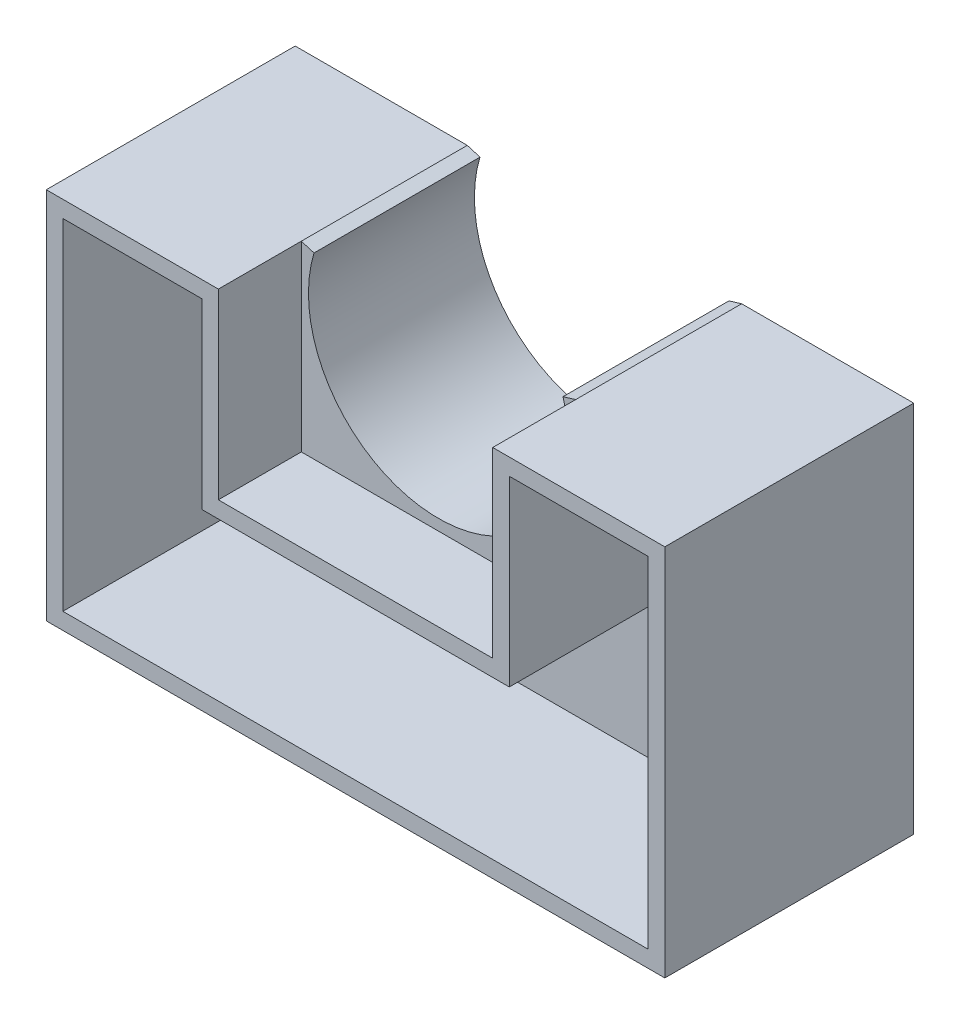
ISO-10303-21;
HEADER;
FILE_DESCRIPTION(('STEP AP214'),'2;1');
FILE_NAME('part.step','',(''),(''),'','','');
FILE_SCHEMA(('AUTOMOTIVE_DESIGN { 1 0 10303 214 1 1 1 1 }'));
ENDSEC;
DATA;
#1=APPLICATION_CONTEXT('core data for automotive mechanical design processes');
#2=APPLICATION_PROTOCOL_DEFINITION('international standard','automotive_design',2000,#1);
#3=PRODUCT_CONTEXT('',#1,'mechanical');
#4=PRODUCT('Part','Part','',(#3));
#5=PRODUCT_RELATED_PRODUCT_CATEGORY('part','',(#4));
#6=PRODUCT_DEFINITION_FORMATION('','',#4);
#7=PRODUCT_DEFINITION_CONTEXT('part definition',#1,'design');
#8=PRODUCT_DEFINITION('design','',#6,#7);
#9=PRODUCT_DEFINITION_SHAPE('','',#8);
#10=(LENGTH_UNIT() NAMED_UNIT(*) SI_UNIT(.MILLI.,.METRE.));
#11=(NAMED_UNIT(*) PLANE_ANGLE_UNIT() SI_UNIT($,.RADIAN.));
#12=(NAMED_UNIT(*) SI_UNIT($,.STERADIAN.) SOLID_ANGLE_UNIT());
#13=UNCERTAINTY_MEASURE_WITH_UNIT(LENGTH_MEASURE(1.E-05),#10,'distance_accuracy_value','');
#14=(GEOMETRIC_REPRESENTATION_CONTEXT(3) GLOBAL_UNCERTAINTY_ASSIGNED_CONTEXT((#13)) GLOBAL_UNIT_ASSIGNED_CONTEXT((#10,
#11,#12)) REPRESENTATION_CONTEXT('',''));
#15=CARTESIAN_POINT('',(0.,0.,0.));
#16=DIRECTION('',(0.,0.,1.));
#17=DIRECTION('',(1.,0.,0.));
#18=AXIS2_PLACEMENT_3D('',#15,#16,#17);
#19=CARTESIAN_POINT('',(10.4991216084109,3.17734995322597,12.7));
#20=DIRECTION('',(0.289656522601476,-0.957130659269893,0.));
#21=DIRECTION('',(0.957130659269893,0.289656522601476,0.));
#22=AXIS2_PLACEMENT_3D('',#19,#20,#21);
#23=PLANE('',#22);
#24=DIRECTION('',(-0.957130659269893,-0.289656522601476,0.));
#25=VECTOR('',#24,1.);
#26=CARTESIAN_POINT('',(10.4991216084109,3.17734995322597,0.));
#27=LINE('',#26,#25);
#28=CARTESIAN_POINT('',(10.4991216084109,3.17734995322597,0.));
#29=VERTEX_POINT('',#28);
#30=CARTESIAN_POINT('',(9.52667685859272,2.88305892626287,0.));
#31=VERTEX_POINT('',#30);
#32=EDGE_CURVE('E394',#29,#31,#27,.T.);
#33=ORIENTED_EDGE('',*,*,#32,.T.);
#34=DIRECTION('',(0.,0.,-1.));
#35=VECTOR('',#34,1.);
#36=CARTESIAN_POINT('',(9.52667685859272,2.88305892626287,12.7));
#37=LINE('',#36,#35);
#38=CARTESIAN_POINT('',(9.52667685859272,2.88305892626287,12.7));
#39=VERTEX_POINT('',#38);
#40=EDGE_CURVE('E40',#39,#31,#37,.T.);
#41=ORIENTED_EDGE('',*,*,#40,.F.);
#42=DIRECTION('',(-0.957130659269893,-0.289656522601476,0.));
#43=VECTOR('',#42,1.);
#44=CARTESIAN_POINT('',(10.4991216084109,3.17734995322597,12.7));
#45=LINE('',#44,#43);
#46=CARTESIAN_POINT('',(10.4991216084109,3.17734995322597,12.7));
#47=VERTEX_POINT('',#46);
#48=EDGE_CURVE('E395',#47,#39,#45,.T.);
#49=ORIENTED_EDGE('',*,*,#48,.F.);
#50=DIRECTION('',(0.,0.,-1.));
#51=VECTOR('',#50,1.);
#52=CARTESIAN_POINT('',(10.4991216084109,3.17734995322597,12.7));
#53=LINE('',#52,#51);
#54=EDGE_CURVE('E11',#47,#29,#53,.T.);
#55=ORIENTED_EDGE('',*,*,#54,.T.);
#56=EDGE_LOOP('',(#33,#41,#49,#55));
#57=FACE_BOUND('',#56,.T.);
#58=ADVANCED_FACE('F33',(#57),#23,.F.);
#59=CARTESIAN_POINT('',(0.,0.,12.7));
#60=DIRECTION('',(0.,0.,-1.));
#61=DIRECTION('',(-1.,0.,0.));
#62=AXIS2_PLACEMENT_3D('',#59,#60,#61);
#63=CYLINDRICAL_SURFACE('',#62,9.95337132535253);
#64=CARTESIAN_POINT('',(0.,0.,0.));
#65=DIRECTION('',(0.,0.,-1.));
#66=DIRECTION('',(1.,0.,0.));
#67=AXIS2_PLACEMENT_3D('',#64,#65,#66);
#68=CIRCLE('',#67,9.95337132535253);
#69=CARTESIAN_POINT('',(-9.5266768585927,2.88305892626291,0.));
#70=VERTEX_POINT('',#69);
#71=EDGE_CURVE('E404',#31,#70,#68,.T.);
#72=ORIENTED_EDGE('',*,*,#71,.T.);
#73=DIRECTION('',(0.,0.,-1.));
#74=VECTOR('',#73,1.);
#75=CARTESIAN_POINT('',(-9.5266768585927,2.88305892626291,12.7));
#76=LINE('',#75,#74);
#77=CARTESIAN_POINT('',(-9.5266768585927,2.88305892626291,12.7));
#78=VERTEX_POINT('',#77);
#79=EDGE_CURVE('E422',#78,#70,#76,.T.);
#80=ORIENTED_EDGE('',*,*,#79,.F.);
#81=CARTESIAN_POINT('',(0.,0.,12.7));
#82=DIRECTION('',(0.,0.,-1.));
#83=DIRECTION('',(1.,0.,0.));
#84=AXIS2_PLACEMENT_3D('',#81,#82,#83);
#85=CIRCLE('',#84,9.95337132535253);
#86=EDGE_CURVE('E397',#39,#78,#85,.T.);
#87=ORIENTED_EDGE('',*,*,#86,.F.);
#88=ORIENTED_EDGE('',*,*,#40,.T.);
#89=EDGE_LOOP('',(#72,#80,#87,#88));
#90=FACE_BOUND('',#89,.T.);
#91=ADVANCED_FACE('F429',(#90),#63,.F.);
#92=CARTESIAN_POINT('',(-9.5266768585927,2.88305892626291,12.7));
#93=DIRECTION('',(-0.289656522601482,-0.957130659269891,0.));
#94=DIRECTION('',(0.957130659269891,-0.289656522601482,0.));
#95=AXIS2_PLACEMENT_3D('',#92,#93,#94);
#96=PLANE('',#95);
#97=DIRECTION('',(-0.957130659269891,0.289656522601482,0.));
#98=VECTOR('',#97,1.);
#99=CARTESIAN_POINT('',(-9.5266768585927,2.88305892626291,0.));
#100=LINE('',#99,#98);
#101=CARTESIAN_POINT('',(-10.4991216084109,3.17734995322601,0.));
#102=VERTEX_POINT('',#101);
#103=EDGE_CURVE('E406',#70,#102,#100,.T.);
#104=ORIENTED_EDGE('',*,*,#103,.T.);
#105=DIRECTION('',(0.,0.,-1.));
#106=VECTOR('',#105,1.);
#107=CARTESIAN_POINT('',(-10.4991216084109,3.17734995322601,12.7));
#108=LINE('',#107,#106);
#109=CARTESIAN_POINT('',(-10.4991216084109,3.17734995322601,12.7));
#110=VERTEX_POINT('',#109);
#111=EDGE_CURVE('E419',#110,#102,#108,.T.);
#112=ORIENTED_EDGE('',*,*,#111,.F.);
#113=DIRECTION('',(-0.957130659269891,0.289656522601482,0.));
#114=VECTOR('',#113,1.);
#115=CARTESIAN_POINT('',(-9.5266768585927,2.88305892626291,12.7));
#116=LINE('',#115,#114);
#117=EDGE_CURVE('E400',#78,#110,#116,.T.);
#118=ORIENTED_EDGE('',*,*,#117,.F.);
#119=ORIENTED_EDGE('',*,*,#79,.T.);
#120=EDGE_LOOP('',(#104,#112,#118,#119));
#121=FACE_BOUND('',#120,.T.);
#122=ADVANCED_FACE('F440',(#121),#96,.F.);
#123=CARTESIAN_POINT('',(-23.6693713253525,-25.4,12.7));
#124=DIRECTION('',(1.,0.,0.));
#125=DIRECTION('',(0.,0.,-1.));
#126=AXIS2_PLACEMENT_3D('',#123,#124,#125);
#127=PLANE('',#126);
#128=DIRECTION('',(0.,-1.,0.));
#129=VECTOR('',#128,1.);
#130=CARTESIAN_POINT('',(-23.6693713253525,-25.4,0.));
#131=LINE('',#130,#129);
#132=CARTESIAN_POINT('',(-23.6693713253525,3.17734995322601,0.));
#133=VERTEX_POINT('',#132);
#134=CARTESIAN_POINT('',(-23.6693713253525,-25.4,0.));
#135=VERTEX_POINT('',#134);
#136=EDGE_CURVE('E409',#133,#135,#131,.T.);
#137=ORIENTED_EDGE('',*,*,#136,.T.);
#138=DIRECTION('',(0.,0.,-1.));
#139=VECTOR('',#138,1.);
#140=CARTESIAN_POINT('',(-23.6693713253525,-25.4,12.7));
#141=LINE('',#140,#139);
#142=CARTESIAN_POINT('',(-23.6693713253525,-25.4,19.05));
#143=VERTEX_POINT('',#142);
#144=EDGE_CURVE('E416',#143,#135,#141,.T.);
#145=ORIENTED_EDGE('',*,*,#144,.F.);
#146=DIRECTION('',(0.,-1.,0.));
#147=VECTOR('',#146,1.);
#148=CARTESIAN_POINT('',(-23.6693713253525,3.17734995322601,19.05));
#149=LINE('',#148,#147);
#150=CARTESIAN_POINT('',(-23.6693713253525,3.17734995322601,19.05));
#151=VERTEX_POINT('',#150);
#152=EDGE_CURVE('E347',#151,#143,#149,.T.);
#153=ORIENTED_EDGE('',*,*,#152,.F.);
#154=DIRECTION('',(0.,0.,1.));
#155=VECTOR('',#154,1.);
#156=CARTESIAN_POINT('',(-23.6693713253525,3.17734995322601,0.));
#157=LINE('',#156,#155);
#158=EDGE_CURVE('E387',#133,#151,#157,.T.);
#159=ORIENTED_EDGE('',*,*,#158,.F.);
#160=EDGE_LOOP('',(#137,#145,#153,#159));
#161=FACE_BOUND('',#160,.T.);
#162=ADVANCED_FACE('F467',(#161),#127,.F.);
#163=CARTESIAN_POINT('',(23.6693713253525,-25.4,12.7));
#164=DIRECTION('',(0.,1.,0.));
#165=DIRECTION('',(0.,0.,1.));
#166=AXIS2_PLACEMENT_3D('',#163,#164,#165);
#167=PLANE('',#166);
#168=DIRECTION('',(1.,0.,0.));
#169=VECTOR('',#168,1.);
#170=CARTESIAN_POINT('',(23.6693713253525,-25.4,0.));
#171=LINE('',#170,#169);
#172=CARTESIAN_POINT('',(23.6693713253525,-25.4,0.));
#173=VERTEX_POINT('',#172);
#174=EDGE_CURVE('E411',#135,#173,#171,.T.);
#175=ORIENTED_EDGE('',*,*,#174,.T.);
#176=DIRECTION('',(0.,0.,-1.));
#177=VECTOR('',#176,1.);
#178=CARTESIAN_POINT('',(23.6693713253525,-25.4,12.7));
#179=LINE('',#178,#177);
#180=CARTESIAN_POINT('',(23.6693713253525,-25.4,19.05));
#181=VERTEX_POINT('',#180);
#182=EDGE_CURVE('E402',#181,#173,#179,.T.);
#183=ORIENTED_EDGE('',*,*,#182,.F.);
#184=DIRECTION('',(1.,0.,0.));
#185=VECTOR('',#184,1.);
#186=CARTESIAN_POINT('',(-23.6693713253525,-25.4,19.05));
#187=LINE('',#186,#185);
#188=EDGE_CURVE('E351',#143,#181,#187,.T.);
#189=ORIENTED_EDGE('',*,*,#188,.F.);
#190=ORIENTED_EDGE('',*,*,#144,.T.);
#191=EDGE_LOOP('',(#175,#183,#189,#190));
#192=FACE_BOUND('',#191,.T.);
#193=ADVANCED_FACE('F460',(#192),#167,.F.);
#194=CARTESIAN_POINT('',(23.6693713253525,-19.05,12.7));
#195=DIRECTION('',(-1.,0.,0.));
#196=DIRECTION('',(0.,-1.,0.));
#197=AXIS2_PLACEMENT_3D('',#194,#195,#196);
#198=PLANE('',#197);
#199=DIRECTION('',(0.,1.,0.));
#200=VECTOR('',#199,1.);
#201=CARTESIAN_POINT('',(23.6693713253525,-19.05,0.));
#202=LINE('',#201,#200);
#203=CARTESIAN_POINT('',(23.6693713253525,3.17734995322597,0.));
#204=VERTEX_POINT('',#203);
#205=EDGE_CURVE('E398',#173,#204,#202,.T.);
#206=ORIENTED_EDGE('',*,*,#205,.T.);
#207=DIRECTION('',(0.,0.,-1.));
#208=VECTOR('',#207,1.);
#209=CARTESIAN_POINT('',(23.6693713253525,3.17734995322597,12.7));
#210=LINE('',#209,#208);
#211=CARTESIAN_POINT('',(23.6693713253525,3.17734995322597,19.05));
#212=VERTEX_POINT('',#211);
#213=EDGE_CURVE('E389',#212,#204,#210,.T.);
#214=ORIENTED_EDGE('',*,*,#213,.F.);
#215=DIRECTION('',(0.,1.,0.));
#216=VECTOR('',#215,1.);
#217=CARTESIAN_POINT('',(23.6693713253525,-25.4,19.05));
#218=LINE('',#217,#216);
#219=EDGE_CURVE('E354',#181,#212,#218,.T.);
#220=ORIENTED_EDGE('',*,*,#219,.F.);
#221=ORIENTED_EDGE('',*,*,#182,.T.);
#222=EDGE_LOOP('',(#206,#214,#220,#221));
#223=FACE_BOUND('',#222,.T.);
#224=ADVANCED_FACE('F456',(#223),#198,.F.);
#225=CARTESIAN_POINT('',(0.,0.,12.7));
#226=DIRECTION('',(0.,0.,1.));
#227=DIRECTION('',(1.,0.,0.));
#228=AXIS2_PLACEMENT_3D('',#225,#226,#227);
#229=PLANE('',#228);
#230=DIRECTION('',(0.,1.,0.));
#231=VECTOR('',#230,1.);
#232=CARTESIAN_POINT('',(-10.4991216084109,3.17734995322601,12.7));
#233=LINE('',#232,#231);
#234=CARTESIAN_POINT('',(-10.4991216084109,-10.792650046774,12.7));
#235=VERTEX_POINT('',#234);
#236=EDGE_CURVE('E348',#235,#110,#233,.T.);
#237=ORIENTED_EDGE('',*,*,#236,.F.);
#238=DIRECTION('',(-1.,0.,0.));
#239=VECTOR('',#238,1.);
#240=CARTESIAN_POINT('',(-10.4991216084109,-10.792650046774,12.7));
#241=LINE('',#240,#239);
#242=CARTESIAN_POINT('',(10.4991216084109,-10.792650046774,12.7));
#243=VERTEX_POINT('',#242);
#244=EDGE_CURVE('E368',#243,#235,#241,.T.);
#245=ORIENTED_EDGE('',*,*,#244,.F.);
#246=DIRECTION('',(0.,-1.,0.));
#247=VECTOR('',#246,1.);
#248=CARTESIAN_POINT('',(10.4991216084109,3.17734995322597,12.7));
#249=LINE('',#248,#247);
#250=EDGE_CURVE('E329',#47,#243,#249,.T.);
#251=ORIENTED_EDGE('',*,*,#250,.F.);
#252=ORIENTED_EDGE('',*,*,#48,.T.);
#253=ORIENTED_EDGE('',*,*,#86,.T.);
#254=ORIENTED_EDGE('',*,*,#117,.T.);
#255=EDGE_LOOP('',(#237,#245,#251,#252,#253,#254));
#256=FACE_BOUND('',#255,.T.);
#257=ADVANCED_FACE('F443',(#256),#229,.T.);
#258=CARTESIAN_POINT('',(0.,0.,0.));
#259=DIRECTION('',(0.,0.,1.));
#260=DIRECTION('',(1.,0.,0.));
#261=AXIS2_PLACEMENT_3D('',#258,#259,#260);
#262=PLANE('',#261);
#263=DIRECTION('',(-1.,0.,0.));
#264=VECTOR('',#263,1.);
#265=CARTESIAN_POINT('',(-2.54,-22.86,0.));
#266=LINE('',#265,#264);
#267=CARTESIAN_POINT('',(2.54,-22.86,0.));
#268=VERTEX_POINT('',#267);
#269=CARTESIAN_POINT('',(-2.54,-22.86,0.));
#270=VERTEX_POINT('',#269);
#271=EDGE_CURVE('E240',#268,#270,#266,.T.);
#272=ORIENTED_EDGE('',*,*,#271,.F.);
#273=DIRECTION('',(0.,-1.,0.));
#274=VECTOR('',#273,1.);
#275=CARTESIAN_POINT('',(2.54,-22.86,0.));
#276=LINE('',#275,#274);
#277=CARTESIAN_POINT('',(2.54,-12.7,0.));
#278=VERTEX_POINT('',#277);
#279=EDGE_CURVE('E47',#278,#268,#276,.T.);
#280=ORIENTED_EDGE('',*,*,#279,.F.);
#281=DIRECTION('',(1.,0.,0.));
#282=VECTOR('',#281,1.);
#283=CARTESIAN_POINT('',(-2.54,-12.7,0.));
#284=LINE('',#283,#282);
#285=CARTESIAN_POINT('',(-2.54,-12.7,0.));
#286=VERTEX_POINT('',#285);
#287=EDGE_CURVE('E231',#286,#278,#284,.T.);
#288=ORIENTED_EDGE('',*,*,#287,.F.);
#289=DIRECTION('',(0.,1.,0.));
#290=VECTOR('',#289,1.);
#291=CARTESIAN_POINT('',(-2.54,-22.86,0.));
#292=LINE('',#291,#290);
#293=EDGE_CURVE('E234',#270,#286,#292,.T.);
#294=ORIENTED_EDGE('',*,*,#293,.F.);
#295=EDGE_LOOP('',(#272,#280,#288,#294));
#296=FACE_BOUND('',#295,.T.);
#297=DIRECTION('',(-1.,0.,0.));
#298=VECTOR('',#297,1.);
#299=CARTESIAN_POINT('',(12.7,-2.54,0.));
#300=LINE('',#299,#298);
#301=CARTESIAN_POINT('',(22.86,-2.54,0.));
#302=VERTEX_POINT('',#301);
#303=CARTESIAN_POINT('',(12.7,-2.54,0.));
#304=VERTEX_POINT('',#303);
#305=EDGE_CURVE('E264',#302,#304,#300,.T.);
#306=ORIENTED_EDGE('',*,*,#305,.F.);
#307=DIRECTION('',(0.,-1.,0.));
#308=VECTOR('',#307,1.);
#309=CARTESIAN_POINT('',(22.86,-2.54,0.));
#310=LINE('',#309,#308);
#311=CARTESIAN_POINT('',(22.86,2.54,0.));
#312=VERTEX_POINT('',#311);
#313=EDGE_CURVE('E55',#312,#302,#310,.T.);
#314=ORIENTED_EDGE('',*,*,#313,.F.);
#315=DIRECTION('',(1.,0.,0.));
#316=VECTOR('',#315,1.);
#317=CARTESIAN_POINT('',(12.7,2.54,0.));
#318=LINE('',#317,#316);
#319=CARTESIAN_POINT('',(12.7,2.54,0.));
#320=VERTEX_POINT('',#319);
#321=EDGE_CURVE('E253',#320,#312,#318,.T.);
#322=ORIENTED_EDGE('',*,*,#321,.F.);
#323=DIRECTION('',(0.,1.,0.));
#324=VECTOR('',#323,1.);
#325=CARTESIAN_POINT('',(12.7,-2.54,0.));
#326=LINE('',#325,#324);
#327=EDGE_CURVE('E267',#304,#320,#326,.T.);
#328=ORIENTED_EDGE('',*,*,#327,.F.);
#329=EDGE_LOOP('',(#306,#314,#322,#328));
#330=FACE_BOUND('',#329,.T.);
#331=ORIENTED_EDGE('',*,*,#32,.F.);
#332=DIRECTION('',(-1.,0.,0.));
#333=VECTOR('',#332,1.);
#334=CARTESIAN_POINT('',(23.6693713253525,3.17734995322597,0.));
#335=LINE('',#334,#333);
#336=EDGE_CURVE('E392',#204,#29,#335,.T.);
#337=ORIENTED_EDGE('',*,*,#336,.F.);
#338=ORIENTED_EDGE('',*,*,#205,.F.);
#339=ORIENTED_EDGE('',*,*,#174,.F.);
#340=ORIENTED_EDGE('',*,*,#136,.F.);
#341=DIRECTION('',(-1.,0.,0.));
#342=VECTOR('',#341,1.);
#343=CARTESIAN_POINT('',(-10.9693713253525,3.17734995322601,0.));
#344=LINE('',#343,#342);
#345=EDGE_CURVE('E384',#102,#133,#344,.T.);
#346=ORIENTED_EDGE('',*,*,#345,.F.);
#347=ORIENTED_EDGE('',*,*,#103,.F.);
#348=ORIENTED_EDGE('',*,*,#71,.F.);
#349=EDGE_LOOP('',(#331,#337,#338,#339,#340,#346,#347,#348));
#350=FACE_BOUND('',#349,.T.);
#351=ADVANCED_FACE('F436',(#296,#330,#350),#262,.F.);
#352=CARTESIAN_POINT('',(0.,3.17734995322597,0.));
#353=DIRECTION('',(0.,1.,0.));
#354=DIRECTION('',(0.,0.,1.));
#355=AXIS2_PLACEMENT_3D('',#352,#353,#354);
#356=PLANE('',#355);
#357=ORIENTED_EDGE('',*,*,#213,.T.);
#358=ORIENTED_EDGE('',*,*,#336,.T.);
#359=ORIENTED_EDGE('',*,*,#54,.F.);
#360=DIRECTION('',(0.,0.,-1.));
#361=VECTOR('',#360,1.);
#362=CARTESIAN_POINT('',(10.4991216084109,3.17734995322597,19.05));
#363=LINE('',#362,#361);
#364=CARTESIAN_POINT('',(10.4991216084109,3.17734995322597,19.05));
#365=VERTEX_POINT('',#364);
#366=EDGE_CURVE('E381',#365,#47,#363,.T.);
#367=ORIENTED_EDGE('',*,*,#366,.F.);
#368=DIRECTION('',(-1.,0.,0.));
#369=VECTOR('',#368,1.);
#370=CARTESIAN_POINT('',(23.6693713253525,3.17734995322597,19.05));
#371=LINE('',#370,#369);
#372=EDGE_CURVE('E357',#212,#365,#371,.T.);
#373=ORIENTED_EDGE('',*,*,#372,.F.);
#374=EDGE_LOOP('',(#357,#358,#359,#367,#373));
#375=FACE_BOUND('',#374,.T.);
#376=ADVANCED_FACE('F452',(#375),#356,.T.);
#377=CARTESIAN_POINT('',(0.,3.17734995322601,0.));
#378=DIRECTION('',(0.,1.,0.));
#379=DIRECTION('',(0.,0.,1.));
#380=AXIS2_PLACEMENT_3D('',#377,#378,#379);
#381=PLANE('',#380);
#382=ORIENTED_EDGE('',*,*,#158,.T.);
#383=DIRECTION('',(-1.,0.,0.));
#384=VECTOR('',#383,1.);
#385=CARTESIAN_POINT('',(-23.6693713253525,3.17734995322601,19.05));
#386=LINE('',#385,#384);
#387=CARTESIAN_POINT('',(-10.4991216084109,3.17734995322601,19.05));
#388=VERTEX_POINT('',#387);
#389=EDGE_CURVE('E344',#388,#151,#386,.T.);
#390=ORIENTED_EDGE('',*,*,#389,.F.);
#391=DIRECTION('',(0.,0.,-1.));
#392=VECTOR('',#391,1.);
#393=CARTESIAN_POINT('',(-10.4991216084109,3.17734995322601,19.05));
#394=LINE('',#393,#392);
#395=EDGE_CURVE('E365',#388,#110,#394,.T.);
#396=ORIENTED_EDGE('',*,*,#395,.T.);
#397=ORIENTED_EDGE('',*,*,#111,.T.);
#398=ORIENTED_EDGE('',*,*,#345,.T.);
#399=EDGE_LOOP('',(#382,#390,#396,#397,#398));
#400=FACE_BOUND('',#399,.T.);
#401=ADVANCED_FACE('F469',(#400),#381,.T.);
#402=CARTESIAN_POINT('',(10.4991216084109,3.17734995322597,19.05));
#403=DIRECTION('',(1.,0.,0.));
#404=DIRECTION('',(0.,1.,0.));
#405=AXIS2_PLACEMENT_3D('',#402,#403,#404);
#406=PLANE('',#405);
#407=ORIENTED_EDGE('',*,*,#250,.T.);
#408=DIRECTION('',(0.,0.,-1.));
#409=VECTOR('',#408,1.);
#410=CARTESIAN_POINT('',(10.4991216084109,-10.792650046774,19.05));
#411=LINE('',#410,#409);
#412=CARTESIAN_POINT('',(10.4991216084109,-10.792650046774,19.05));
#413=VERTEX_POINT('',#412);
#414=EDGE_CURVE('E378',#413,#243,#411,.T.);
#415=ORIENTED_EDGE('',*,*,#414,.F.);
#416=DIRECTION('',(0.,-1.,0.));
#417=VECTOR('',#416,1.);
#418=CARTESIAN_POINT('',(10.4991216084109,3.17734995322597,19.05));
#419=LINE('',#418,#417);
#420=EDGE_CURVE('E359',#365,#413,#419,.T.);
#421=ORIENTED_EDGE('',*,*,#420,.F.);
#422=ORIENTED_EDGE('',*,*,#366,.T.);
#423=EDGE_LOOP('',(#407,#415,#421,#422));
#424=FACE_BOUND('',#423,.T.);
#425=ADVANCED_FACE('F448',(#424),#406,.F.);
#426=CARTESIAN_POINT('',(-10.4991216084109,-10.792650046774,19.05));
#427=DIRECTION('',(0.,-1.,0.));
#428=DIRECTION('',(0.,0.,-1.));
#429=AXIS2_PLACEMENT_3D('',#426,#427,#428);
#430=PLANE('',#429);
#431=ORIENTED_EDGE('',*,*,#244,.T.);
#432=DIRECTION('',(0.,0.,-1.));
#433=VECTOR('',#432,1.);
#434=CARTESIAN_POINT('',(-10.4991216084109,-10.792650046774,19.05));
#435=LINE('',#434,#433);
#436=CARTESIAN_POINT('',(-10.4991216084109,-10.792650046774,19.05));
#437=VERTEX_POINT('',#436);
#438=EDGE_CURVE('E375',#437,#235,#435,.T.);
#439=ORIENTED_EDGE('',*,*,#438,.F.);
#440=DIRECTION('',(-1.,0.,0.));
#441=VECTOR('',#440,1.);
#442=CARTESIAN_POINT('',(-10.4991216084109,-10.792650046774,19.05));
#443=LINE('',#442,#441);
#444=EDGE_CURVE('E361',#413,#437,#443,.T.);
#445=ORIENTED_EDGE('',*,*,#444,.F.);
#446=ORIENTED_EDGE('',*,*,#414,.T.);
#447=EDGE_LOOP('',(#431,#439,#445,#446));
#448=FACE_BOUND('',#447,.T.);
#449=ADVANCED_FACE('F477',(#448),#430,.F.);
#450=CARTESIAN_POINT('',(-10.4991216084109,3.17734995322601,19.05));
#451=DIRECTION('',(-1.,0.,0.));
#452=DIRECTION('',(0.,-1.,0.));
#453=AXIS2_PLACEMENT_3D('',#450,#451,#452);
#454=PLANE('',#453);
#455=ORIENTED_EDGE('',*,*,#236,.T.);
#456=ORIENTED_EDGE('',*,*,#395,.F.);
#457=DIRECTION('',(0.,1.,0.));
#458=VECTOR('',#457,1.);
#459=CARTESIAN_POINT('',(-10.4991216084109,3.17734995322601,19.05));
#460=LINE('',#459,#458);
#461=EDGE_CURVE('E363',#437,#388,#460,.T.);
#462=ORIENTED_EDGE('',*,*,#461,.F.);
#463=ORIENTED_EDGE('',*,*,#438,.T.);
#464=EDGE_LOOP('',(#455,#456,#462,#463));
#465=FACE_BOUND('',#464,.T.);
#466=ADVANCED_FACE('F473',(#465),#454,.F.);
#467=CARTESIAN_POINT('',(0.,0.,19.05));
#468=DIRECTION('',(0.,0.,-1.));
#469=DIRECTION('',(-1.,0.,0.));
#470=AXIS2_PLACEMENT_3D('',#467,#468,#469);
#471=PLANE('',#470);
#472=DIRECTION('',(-1.,0.,0.));
#473=VECTOR('',#472,1.);
#474=CARTESIAN_POINT('',(-11.7691216084109,1.90734995322601,19.05));
#475=LINE('',#474,#473);
#476=CARTESIAN_POINT('',(-11.7691216084109,1.90734995322601,19.05));
#477=VERTEX_POINT('',#476);
#478=CARTESIAN_POINT('',(-22.3993713253525,1.90734995322601,19.05));
#479=VERTEX_POINT('',#478);
#480=EDGE_CURVE('E307',#477,#479,#475,.T.);
#481=ORIENTED_EDGE('',*,*,#480,.F.);
#482=DIRECTION('',(0.,1.,0.));
#483=VECTOR('',#482,1.);
#484=CARTESIAN_POINT('',(-11.7691216084109,-12.062650046774,19.05));
#485=LINE('',#484,#483);
#486=CARTESIAN_POINT('',(-11.7691216084109,-12.062650046774,19.05));
#487=VERTEX_POINT('',#486);
#488=EDGE_CURVE('E274',#487,#477,#485,.T.);
#489=ORIENTED_EDGE('',*,*,#488,.F.);
#490=DIRECTION('',(-1.,0.,0.));
#491=VECTOR('',#490,1.);
#492=CARTESIAN_POINT('',(11.7691216084109,-12.062650046774,19.05));
#493=LINE('',#492,#491);
#494=CARTESIAN_POINT('',(11.7691216084109,-12.062650046774,19.05));
#495=VERTEX_POINT('',#494);
#496=EDGE_CURVE('E284',#495,#487,#493,.T.);
#497=ORIENTED_EDGE('',*,*,#496,.F.);
#498=DIRECTION('',(0.,-1.,0.));
#499=VECTOR('',#498,1.);
#500=CARTESIAN_POINT('',(11.7691216084109,1.90734995322597,19.05));
#501=LINE('',#500,#499);
#502=CARTESIAN_POINT('',(11.7691216084109,1.90734995322597,19.05));
#503=VERTEX_POINT('',#502);
#504=EDGE_CURVE('E322',#503,#495,#501,.T.);
#505=ORIENTED_EDGE('',*,*,#504,.F.);
#506=DIRECTION('',(-1.,0.,0.));
#507=VECTOR('',#506,1.);
#508=CARTESIAN_POINT('',(22.3993713253525,1.90734995322597,19.05));
#509=LINE('',#508,#507);
#510=CARTESIAN_POINT('',(22.3993713253525,1.90734995322597,19.05));
#511=VERTEX_POINT('',#510);
#512=EDGE_CURVE('E319',#511,#503,#509,.T.);
#513=ORIENTED_EDGE('',*,*,#512,.F.);
#514=DIRECTION('',(0.,1.,0.));
#515=VECTOR('',#514,1.);
#516=CARTESIAN_POINT('',(22.3993713253525,-24.13,19.05));
#517=LINE('',#516,#515);
#518=CARTESIAN_POINT('',(22.3993713253525,-24.13,19.05));
#519=VERTEX_POINT('',#518);
#520=EDGE_CURVE('E316',#519,#511,#517,.T.);
#521=ORIENTED_EDGE('',*,*,#520,.F.);
#522=DIRECTION('',(1.,0.,0.));
#523=VECTOR('',#522,1.);
#524=CARTESIAN_POINT('',(-22.3993713253525,-24.13,19.05));
#525=LINE('',#524,#523);
#526=CARTESIAN_POINT('',(-22.3993713253525,-24.13,19.05));
#527=VERTEX_POINT('',#526);
#528=EDGE_CURVE('E313',#527,#519,#525,.T.);
#529=ORIENTED_EDGE('',*,*,#528,.F.);
#530=DIRECTION('',(0.,-1.,0.));
#531=VECTOR('',#530,1.);
#532=CARTESIAN_POINT('',(-22.3993713253525,1.90734995322601,19.05));
#533=LINE('',#532,#531);
#534=EDGE_CURVE('E310',#479,#527,#533,.T.);
#535=ORIENTED_EDGE('',*,*,#534,.F.);
#536=EDGE_LOOP('',(#481,#489,#497,#505,#513,#521,#529,#535));
#537=FACE_BOUND('',#536,.T.);
#538=ORIENTED_EDGE('',*,*,#389,.T.);
#539=ORIENTED_EDGE('',*,*,#152,.T.);
#540=ORIENTED_EDGE('',*,*,#188,.T.);
#541=ORIENTED_EDGE('',*,*,#219,.T.);
#542=ORIENTED_EDGE('',*,*,#372,.T.);
#543=ORIENTED_EDGE('',*,*,#420,.T.);
#544=ORIENTED_EDGE('',*,*,#444,.T.);
#545=ORIENTED_EDGE('',*,*,#461,.T.);
#546=EDGE_LOOP('',(#538,#539,#540,#541,#542,#543,#544,#545));
#547=FACE_BOUND('',#546,.T.);
#548=ADVANCED_FACE('F462',(#537,#547),#471,.F.);
#549=CARTESIAN_POINT('',(-11.7691216084109,-12.062650046774,6.35));
#550=DIRECTION('',(1.,0.,0.));
#551=DIRECTION('',(0.,1.,0.));
#552=AXIS2_PLACEMENT_3D('',#549,#550,#551);
#553=PLANE('',#552);
#554=ORIENTED_EDGE('',*,*,#488,.T.);
#555=DIRECTION('',(0.,0.,1.));
#556=VECTOR('',#555,1.);
#557=CARTESIAN_POINT('',(-11.7691216084109,1.90734995322601,6.35));
#558=LINE('',#557,#556);
#559=CARTESIAN_POINT('',(-11.7691216084109,1.90734995322601,6.35));
#560=VERTEX_POINT('',#559);
#561=EDGE_CURVE('E305',#560,#477,#558,.T.);
#562=ORIENTED_EDGE('',*,*,#561,.F.);
#563=DIRECTION('',(0.,1.,0.));
#564=VECTOR('',#563,1.);
#565=CARTESIAN_POINT('',(-11.7691216084109,-12.062650046774,6.35));
#566=LINE('',#565,#564);
#567=CARTESIAN_POINT('',(-11.7691216084109,-12.062650046774,6.35));
#568=VERTEX_POINT('',#567);
#569=EDGE_CURVE('E280',#568,#560,#566,.T.);
#570=ORIENTED_EDGE('',*,*,#569,.F.);
#571=DIRECTION('',(0.,0.,1.));
#572=VECTOR('',#571,1.);
#573=CARTESIAN_POINT('',(-11.7691216084109,-12.062650046774,6.35));
#574=LINE('',#573,#572);
#575=EDGE_CURVE('E327',#568,#487,#574,.T.);
#576=ORIENTED_EDGE('',*,*,#575,.T.);
#577=EDGE_LOOP('',(#554,#562,#570,#576));
#578=FACE_BOUND('',#577,.T.);
#579=ADVANCED_FACE('F536',(#578),#553,.F.);
#580=CARTESIAN_POINT('',(11.7691216084109,-12.062650046774,6.35));
#581=DIRECTION('',(0.,1.,0.));
#582=DIRECTION('',(0.,0.,1.));
#583=AXIS2_PLACEMENT_3D('',#580,#581,#582);
#584=PLANE('',#583);
#585=ORIENTED_EDGE('',*,*,#496,.T.);
#586=ORIENTED_EDGE('',*,*,#575,.F.);
#587=DIRECTION('',(-1.,0.,0.));
#588=VECTOR('',#587,1.);
#589=CARTESIAN_POINT('',(11.7691216084109,-12.062650046774,6.35));
#590=LINE('',#589,#588);
#591=CARTESIAN_POINT('',(11.7691216084109,-12.062650046774,6.35));
#592=VERTEX_POINT('',#591);
#593=EDGE_CURVE('E302',#592,#568,#590,.T.);
#594=ORIENTED_EDGE('',*,*,#593,.F.);
#595=DIRECTION('',(0.,0.,1.));
#596=VECTOR('',#595,1.);
#597=CARTESIAN_POINT('',(11.7691216084109,-12.062650046774,6.35));
#598=LINE('',#597,#596);
#599=EDGE_CURVE('E330',#592,#495,#598,.T.);
#600=ORIENTED_EDGE('',*,*,#599,.T.);
#601=EDGE_LOOP('',(#585,#586,#594,#600));
#602=FACE_BOUND('',#601,.T.);
#603=ADVANCED_FACE('F546',(#602),#584,.F.);
#604=CARTESIAN_POINT('',(11.7691216084109,1.90734995322597,6.35));
#605=DIRECTION('',(-1.,0.,0.));
#606=DIRECTION('',(0.,-1.,0.));
#607=AXIS2_PLACEMENT_3D('',#604,#605,#606);
#608=PLANE('',#607);
#609=ORIENTED_EDGE('',*,*,#504,.T.);
#610=ORIENTED_EDGE('',*,*,#599,.F.);
#611=DIRECTION('',(0.,-1.,0.));
#612=VECTOR('',#611,1.);
#613=CARTESIAN_POINT('',(11.7691216084109,1.90734995322597,6.35));
#614=LINE('',#613,#612);
#615=CARTESIAN_POINT('',(11.7691216084109,1.90734995322597,6.35));
#616=VERTEX_POINT('',#615);
#617=EDGE_CURVE('E299',#616,#592,#614,.T.);
#618=ORIENTED_EDGE('',*,*,#617,.F.);
#619=DIRECTION('',(0.,0.,1.));
#620=VECTOR('',#619,1.);
#621=CARTESIAN_POINT('',(11.7691216084109,1.90734995322597,6.35));
#622=LINE('',#621,#620);
#623=EDGE_CURVE('E332',#616,#503,#622,.T.);
#624=ORIENTED_EDGE('',*,*,#623,.T.);
#625=EDGE_LOOP('',(#609,#610,#618,#624));
#626=FACE_BOUND('',#625,.T.);
#627=ADVANCED_FACE('F556',(#626),#608,.F.);
#628=CARTESIAN_POINT('',(22.3993713253525,1.90734995322597,6.35));
#629=DIRECTION('',(0.,1.,0.));
#630=DIRECTION('',(0.,0.,1.));
#631=AXIS2_PLACEMENT_3D('',#628,#629,#630);
#632=PLANE('',#631);
#633=ORIENTED_EDGE('',*,*,#512,.T.);
#634=ORIENTED_EDGE('',*,*,#623,.F.);
#635=DIRECTION('',(-1.,0.,0.));
#636=VECTOR('',#635,1.);
#637=CARTESIAN_POINT('',(22.3993713253525,1.90734995322597,6.35));
#638=LINE('',#637,#636);
#639=CARTESIAN_POINT('',(22.3993713253525,1.90734995322597,6.35));
#640=VERTEX_POINT('',#639);
#641=EDGE_CURVE('E296',#640,#616,#638,.T.);
#642=ORIENTED_EDGE('',*,*,#641,.F.);
#643=DIRECTION('',(0.,0.,1.));
#644=VECTOR('',#643,1.);
#645=CARTESIAN_POINT('',(22.3993713253525,1.90734995322597,6.35));
#646=LINE('',#645,#644);
#647=EDGE_CURVE('E334',#640,#511,#646,.T.);
#648=ORIENTED_EDGE('',*,*,#647,.T.);
#649=EDGE_LOOP('',(#633,#634,#642,#648));
#650=FACE_BOUND('',#649,.T.);
#651=ADVANCED_FACE('F566',(#650),#632,.F.);
#652=CARTESIAN_POINT('',(22.3993713253525,-24.13,6.35));
#653=DIRECTION('',(1.,0.,0.));
#654=DIRECTION('',(0.,1.,0.));
#655=AXIS2_PLACEMENT_3D('',#652,#653,#654);
#656=PLANE('',#655);
#657=ORIENTED_EDGE('',*,*,#520,.T.);
#658=ORIENTED_EDGE('',*,*,#647,.F.);
#659=DIRECTION('',(0.,1.,0.));
#660=VECTOR('',#659,1.);
#661=CARTESIAN_POINT('',(22.3993713253525,-24.13,6.35));
#662=LINE('',#661,#660);
#663=CARTESIAN_POINT('',(22.3993713253525,-24.13,6.35));
#664=VERTEX_POINT('',#663);
#665=EDGE_CURVE('E293',#664,#640,#662,.T.);
#666=ORIENTED_EDGE('',*,*,#665,.F.);
#667=DIRECTION('',(0.,0.,1.));
#668=VECTOR('',#667,1.);
#669=CARTESIAN_POINT('',(22.3993713253525,-24.13,6.35));
#670=LINE('',#669,#668);
#671=EDGE_CURVE('E336',#664,#519,#670,.T.);
#672=ORIENTED_EDGE('',*,*,#671,.T.);
#673=EDGE_LOOP('',(#657,#658,#666,#672));
#674=FACE_BOUND('',#673,.T.);
#675=ADVANCED_FACE('F576',(#674),#656,.F.);
#676=CARTESIAN_POINT('',(-22.3993713253525,-24.13,6.35));
#677=DIRECTION('',(0.,-1.,0.));
#678=DIRECTION('',(0.,0.,-1.));
#679=AXIS2_PLACEMENT_3D('',#676,#677,#678);
#680=PLANE('',#679);
#681=ORIENTED_EDGE('',*,*,#528,.T.);
#682=ORIENTED_EDGE('',*,*,#671,.F.);
#683=DIRECTION('',(1.,0.,0.));
#684=VECTOR('',#683,1.);
#685=CARTESIAN_POINT('',(-22.3993713253525,-24.13,6.35));
#686=LINE('',#685,#684);
#687=CARTESIAN_POINT('',(-22.3993713253525,-24.13,6.35));
#688=VERTEX_POINT('',#687);
#689=EDGE_CURVE('E290',#688,#664,#686,.T.);
#690=ORIENTED_EDGE('',*,*,#689,.F.);
#691=DIRECTION('',(0.,0.,1.));
#692=VECTOR('',#691,1.);
#693=CARTESIAN_POINT('',(-22.3993713253525,-24.13,6.35));
#694=LINE('',#693,#692);
#695=EDGE_CURVE('E338',#688,#527,#694,.T.);
#696=ORIENTED_EDGE('',*,*,#695,.T.);
#697=EDGE_LOOP('',(#681,#682,#690,#696));
#698=FACE_BOUND('',#697,.T.);
#699=ADVANCED_FACE('F586',(#698),#680,.F.);
#700=CARTESIAN_POINT('',(-22.3993713253525,1.90734995322601,6.35));
#701=DIRECTION('',(-1.,0.,0.));
#702=DIRECTION('',(0.,0.,1.));
#703=AXIS2_PLACEMENT_3D('',#700,#701,#702);
#704=PLANE('',#703);
#705=ORIENTED_EDGE('',*,*,#534,.T.);
#706=ORIENTED_EDGE('',*,*,#695,.F.);
#707=DIRECTION('',(0.,-1.,0.));
#708=VECTOR('',#707,1.);
#709=CARTESIAN_POINT('',(-22.3993713253525,1.90734995322601,6.35));
#710=LINE('',#709,#708);
#711=CARTESIAN_POINT('',(-22.3993713253525,1.90734995322601,6.35));
#712=VERTEX_POINT('',#711);
#713=EDGE_CURVE('E287',#712,#688,#710,.T.);
#714=ORIENTED_EDGE('',*,*,#713,.F.);
#715=DIRECTION('',(0.,0.,1.));
#716=VECTOR('',#715,1.);
#717=CARTESIAN_POINT('',(-22.3993713253525,1.90734995322601,6.35));
#718=LINE('',#717,#716);
#719=EDGE_CURVE('E340',#712,#479,#718,.T.);
#720=ORIENTED_EDGE('',*,*,#719,.T.);
#721=EDGE_LOOP('',(#705,#706,#714,#720));
#722=FACE_BOUND('',#721,.T.);
#723=ADVANCED_FACE('F596',(#722),#704,.F.);
#724=CARTESIAN_POINT('',(-11.7691216084109,1.90734995322601,6.35));
#725=DIRECTION('',(0.,1.,0.));
#726=DIRECTION('',(-1.,0.,0.));
#727=AXIS2_PLACEMENT_3D('',#724,#725,#726);
#728=PLANE('',#727);
#729=ORIENTED_EDGE('',*,*,#480,.T.);
#730=ORIENTED_EDGE('',*,*,#719,.F.);
#731=DIRECTION('',(-1.,0.,0.));
#732=VECTOR('',#731,1.);
#733=CARTESIAN_POINT('',(-11.7691216084109,1.90734995322601,6.35));
#734=LINE('',#733,#732);
#735=EDGE_CURVE('E283',#560,#712,#734,.T.);
#736=ORIENTED_EDGE('',*,*,#735,.F.);
#737=ORIENTED_EDGE('',*,*,#561,.T.);
#738=EDGE_LOOP('',(#729,#730,#736,#737));
#739=FACE_BOUND('',#738,.T.);
#740=ADVANCED_FACE('F606',(#739),#728,.F.);
#741=CARTESIAN_POINT('',(0.,0.,6.35));
#742=DIRECTION('',(0.,0.,1.));
#743=DIRECTION('',(1.,0.,0.));
#744=AXIS2_PLACEMENT_3D('',#741,#742,#743);
#745=PLANE('',#744);
#746=ORIENTED_EDGE('',*,*,#569,.T.);
#747=ORIENTED_EDGE('',*,*,#735,.T.);
#748=ORIENTED_EDGE('',*,*,#713,.T.);
#749=ORIENTED_EDGE('',*,*,#689,.T.);
#750=ORIENTED_EDGE('',*,*,#665,.T.);
#751=ORIENTED_EDGE('',*,*,#641,.T.);
#752=ORIENTED_EDGE('',*,*,#617,.T.);
#753=ORIENTED_EDGE('',*,*,#593,.T.);
#754=EDGE_LOOP('',(#746,#747,#748,#749,#750,#751,#752,#753));
#755=FACE_BOUND('',#754,.T.);
#756=ADVANCED_FACE('F616',(#755),#745,.T.);
#757=CARTESIAN_POINT('',(22.86,-2.54,2.));
#758=DIRECTION('',(1.,0.,0.));
#759=DIRECTION('',(0.,0.,-1.));
#760=AXIS2_PLACEMENT_3D('',#757,#758,#759);
#761=PLANE('',#760);
#762=ORIENTED_EDGE('',*,*,#313,.T.);
#763=DIRECTION('',(0.,0.,-1.));
#764=VECTOR('',#763,1.);
#765=CARTESIAN_POINT('',(22.86,-2.54,2.));
#766=LINE('',#765,#764);
#767=CARTESIAN_POINT('',(22.86,-2.54,2.));
#768=VERTEX_POINT('',#767);
#769=EDGE_CURVE('E262',#768,#302,#766,.T.);
#770=ORIENTED_EDGE('',*,*,#769,.F.);
#771=DIRECTION('',(0.,-1.,0.));
#772=VECTOR('',#771,1.);
#773=CARTESIAN_POINT('',(22.86,-2.54,2.));
#774=LINE('',#773,#772);
#775=CARTESIAN_POINT('',(22.86,2.54,2.));
#776=VERTEX_POINT('',#775);
#777=EDGE_CURVE('E249',#776,#768,#774,.T.);
#778=ORIENTED_EDGE('',*,*,#777,.F.);
#779=DIRECTION('',(0.,0.,-1.));
#780=VECTOR('',#779,1.);
#781=CARTESIAN_POINT('',(22.86,2.54,2.));
#782=LINE('',#781,#780);
#783=EDGE_CURVE('E272',#776,#312,#782,.T.);
#784=ORIENTED_EDGE('',*,*,#783,.T.);
#785=EDGE_LOOP('',(#762,#770,#778,#784));
#786=FACE_BOUND('',#785,.T.);
#787=ADVANCED_FACE('F626',(#786),#761,.F.);
#788=CARTESIAN_POINT('',(12.7,2.54,2.));
#789=DIRECTION('',(0.,1.,0.));
#790=DIRECTION('',(-1.,0.,0.));
#791=AXIS2_PLACEMENT_3D('',#788,#789,#790);
#792=PLANE('',#791);
#793=ORIENTED_EDGE('',*,*,#321,.T.);
#794=ORIENTED_EDGE('',*,*,#783,.F.);
#795=DIRECTION('',(1.,0.,0.));
#796=VECTOR('',#795,1.);
#797=CARTESIAN_POINT('',(12.7,2.54,2.));
#798=LINE('',#797,#796);
#799=CARTESIAN_POINT('',(12.7,2.54,2.));
#800=VERTEX_POINT('',#799);
#801=EDGE_CURVE('E259',#800,#776,#798,.T.);
#802=ORIENTED_EDGE('',*,*,#801,.F.);
#803=DIRECTION('',(0.,0.,-1.));
#804=VECTOR('',#803,1.);
#805=CARTESIAN_POINT('',(12.7,2.54,2.));
#806=LINE('',#805,#804);
#807=EDGE_CURVE('E275',#800,#320,#806,.T.);
#808=ORIENTED_EDGE('',*,*,#807,.T.);
#809=EDGE_LOOP('',(#793,#794,#802,#808));
#810=FACE_BOUND('',#809,.T.);
#811=ADVANCED_FACE('F645',(#810),#792,.F.);
#812=CARTESIAN_POINT('',(12.7,-2.54,2.));
#813=DIRECTION('',(-1.,0.,0.));
#814=DIRECTION('',(0.,0.,1.));
#815=AXIS2_PLACEMENT_3D('',#812,#813,#814);
#816=PLANE('',#815);
#817=ORIENTED_EDGE('',*,*,#327,.T.);
#818=ORIENTED_EDGE('',*,*,#807,.F.);
#819=DIRECTION('',(0.,1.,0.));
#820=VECTOR('',#819,1.);
#821=CARTESIAN_POINT('',(12.7,-2.54,2.));
#822=LINE('',#821,#820);
#823=CARTESIAN_POINT('',(12.7,-2.54,2.));
#824=VERTEX_POINT('',#823);
#825=EDGE_CURVE('E256',#824,#800,#822,.T.);
#826=ORIENTED_EDGE('',*,*,#825,.F.);
#827=DIRECTION('',(0.,0.,-1.));
#828=VECTOR('',#827,1.);
#829=CARTESIAN_POINT('',(12.7,-2.54,2.));
#830=LINE('',#829,#828);
#831=EDGE_CURVE('E277',#824,#304,#830,.T.);
#832=ORIENTED_EDGE('',*,*,#831,.T.);
#833=EDGE_LOOP('',(#817,#818,#826,#832));
#834=FACE_BOUND('',#833,.T.);
#835=ADVANCED_FACE('F654',(#834),#816,.F.);
#836=CARTESIAN_POINT('',(12.7,-2.54,2.));
#837=DIRECTION('',(0.,-1.,0.));
#838=DIRECTION('',(1.,0.,0.));
#839=AXIS2_PLACEMENT_3D('',#836,#837,#838);
#840=PLANE('',#839);
#841=ORIENTED_EDGE('',*,*,#305,.T.);
#842=ORIENTED_EDGE('',*,*,#831,.F.);
#843=DIRECTION('',(-1.,0.,0.));
#844=VECTOR('',#843,1.);
#845=CARTESIAN_POINT('',(12.7,-2.54,2.));
#846=LINE('',#845,#844);
#847=EDGE_CURVE('E252',#768,#824,#846,.T.);
#848=ORIENTED_EDGE('',*,*,#847,.F.);
#849=ORIENTED_EDGE('',*,*,#769,.T.);
#850=EDGE_LOOP('',(#841,#842,#848,#849));
#851=FACE_BOUND('',#850,.T.);
#852=ADVANCED_FACE('F664',(#851),#840,.F.);
#853=CARTESIAN_POINT('',(0.,0.,2.));
#854=DIRECTION('',(0.,0.,-1.));
#855=DIRECTION('',(-1.,0.,0.));
#856=AXIS2_PLACEMENT_3D('',#853,#854,#855);
#857=PLANE('',#856);
#858=ORIENTED_EDGE('',*,*,#777,.T.);
#859=ORIENTED_EDGE('',*,*,#847,.T.);
#860=ORIENTED_EDGE('',*,*,#825,.T.);
#861=ORIENTED_EDGE('',*,*,#801,.T.);
#862=EDGE_LOOP('',(#858,#859,#860,#861));
#863=FACE_BOUND('',#862,.T.);
#864=ADVANCED_FACE('F674',(#863),#857,.T.);
#865=CARTESIAN_POINT('',(2.54,-22.86,2.));
#866=DIRECTION('',(1.,0.,0.));
#867=DIRECTION('',(0.,0.,-1.));
#868=AXIS2_PLACEMENT_3D('',#865,#866,#867);
#869=PLANE('',#868);
#870=ORIENTED_EDGE('',*,*,#279,.T.);
#871=DIRECTION('',(0.,0.,-1.));
#872=VECTOR('',#871,1.);
#873=CARTESIAN_POINT('',(2.54,-22.86,2.));
#874=LINE('',#873,#872);
#875=CARTESIAN_POINT('',(2.54,-22.86,2.));
#876=VERTEX_POINT('',#875);
#877=EDGE_CURVE('E209',#876,#268,#874,.T.);
#878=ORIENTED_EDGE('',*,*,#877,.F.);
#879=DIRECTION('',(0.,-1.,0.));
#880=VECTOR('',#879,1.);
#881=CARTESIAN_POINT('',(2.54,-22.86,2.));
#882=LINE('',#881,#880);
#883=CARTESIAN_POINT('',(2.54,-12.7,2.));
#884=VERTEX_POINT('',#883);
#885=EDGE_CURVE('E213',#884,#876,#882,.T.);
#886=ORIENTED_EDGE('',*,*,#885,.F.);
#887=DIRECTION('',(0.,0.,-1.));
#888=VECTOR('',#887,1.);
#889=CARTESIAN_POINT('',(2.54,-12.7,2.));
#890=LINE('',#889,#888);
#891=EDGE_CURVE('E244',#884,#278,#890,.T.);
#892=ORIENTED_EDGE('',*,*,#891,.T.);
#893=EDGE_LOOP('',(#870,#878,#886,#892));
#894=FACE_BOUND('',#893,.T.);
#895=ADVANCED_FACE('F211',(#894),#869,.F.);
#896=CARTESIAN_POINT('',(-2.54,-12.7,2.));
#897=DIRECTION('',(0.,1.,0.));
#898=DIRECTION('',(0.,0.,1.));
#899=AXIS2_PLACEMENT_3D('',#896,#897,#898);
#900=PLANE('',#899);
#901=ORIENTED_EDGE('',*,*,#287,.T.);
#902=ORIENTED_EDGE('',*,*,#891,.F.);
#903=DIRECTION('',(1.,0.,0.));
#904=VECTOR('',#903,1.);
#905=CARTESIAN_POINT('',(-2.54,-12.7,2.));
#906=LINE('',#905,#904);
#907=CARTESIAN_POINT('',(-2.54,-12.7,2.));
#908=VERTEX_POINT('',#907);
#909=EDGE_CURVE('E219',#908,#884,#906,.T.);
#910=ORIENTED_EDGE('',*,*,#909,.F.);
#911=DIRECTION('',(0.,0.,-1.));
#912=VECTOR('',#911,1.);
#913=CARTESIAN_POINT('',(-2.54,-12.7,2.));
#914=LINE('',#913,#912);
#915=EDGE_CURVE('E246',#908,#286,#914,.T.);
#916=ORIENTED_EDGE('',*,*,#915,.T.);
#917=EDGE_LOOP('',(#901,#902,#910,#916));
#918=FACE_BOUND('',#917,.T.);
#919=ADVANCED_FACE('F693',(#918),#900,.F.);
#920=CARTESIAN_POINT('',(-2.54,-22.86,2.));
#921=DIRECTION('',(-1.,0.,0.));
#922=DIRECTION('',(0.,0.,1.));
#923=AXIS2_PLACEMENT_3D('',#920,#921,#922);
#924=PLANE('',#923);
#925=ORIENTED_EDGE('',*,*,#293,.T.);
#926=ORIENTED_EDGE('',*,*,#915,.F.);
#927=DIRECTION('',(0.,1.,0.));
#928=VECTOR('',#927,1.);
#929=CARTESIAN_POINT('',(-2.54,-22.86,2.));
#930=LINE('',#929,#928);
#931=CARTESIAN_POINT('',(-2.54,-22.86,2.));
#932=VERTEX_POINT('',#931);
#933=EDGE_CURVE('E227',#932,#908,#930,.T.);
#934=ORIENTED_EDGE('',*,*,#933,.F.);
#935=DIRECTION('',(0.,0.,-1.));
#936=VECTOR('',#935,1.);
#937=CARTESIAN_POINT('',(-2.54,-22.86,2.));
#938=LINE('',#937,#936);
#939=EDGE_CURVE('E218',#932,#270,#938,.T.);
#940=ORIENTED_EDGE('',*,*,#939,.T.);
#941=EDGE_LOOP('',(#925,#926,#934,#940));
#942=FACE_BOUND('',#941,.T.);
#943=ADVANCED_FACE('F702',(#942),#924,.F.);
#944=CARTESIAN_POINT('',(-2.54,-22.86,2.));
#945=DIRECTION('',(0.,-1.,0.));
#946=DIRECTION('',(0.,0.,-1.));
#947=AXIS2_PLACEMENT_3D('',#944,#945,#946);
#948=PLANE('',#947);
#949=ORIENTED_EDGE('',*,*,#271,.T.);
#950=ORIENTED_EDGE('',*,*,#939,.F.);
#951=DIRECTION('',(-1.,0.,0.));
#952=VECTOR('',#951,1.);
#953=CARTESIAN_POINT('',(-2.54,-22.86,2.));
#954=LINE('',#953,#952);
#955=EDGE_CURVE('E222',#876,#932,#954,.T.);
#956=ORIENTED_EDGE('',*,*,#955,.F.);
#957=ORIENTED_EDGE('',*,*,#877,.T.);
#958=EDGE_LOOP('',(#949,#950,#956,#957));
#959=FACE_BOUND('',#958,.T.);
#960=ADVANCED_FACE('F223',(#959),#948,.F.);
#961=CARTESIAN_POINT('',(0.,0.,2.));
#962=DIRECTION('',(0.,0.,-1.));
#963=DIRECTION('',(-1.,0.,0.));
#964=AXIS2_PLACEMENT_3D('',#961,#962,#963);
#965=PLANE('',#964);
#966=ORIENTED_EDGE('',*,*,#885,.T.);
#967=ORIENTED_EDGE('',*,*,#955,.T.);
#968=ORIENTED_EDGE('',*,*,#933,.T.);
#969=ORIENTED_EDGE('',*,*,#909,.T.);
#970=EDGE_LOOP('',(#966,#967,#968,#969));
#971=FACE_BOUND('',#970,.T.);
#972=ADVANCED_FACE('F229',(#971),#965,.T.);
#973=CLOSED_SHELL('',(#58,#91,#122,#162,#193,#224,#257,#351,#376,#401,#425,#449,#466,#548,#579,
#603,#627,#651,#675,#699,#723,#740,#756,#787,#811,#835,#852,#864,#895,#919,#943,#960,#972));
#974=MANIFOLD_SOLID_BREP('B2',#973);
#975=ADVANCED_BREP_SHAPE_REPRESENTATION('',(#18,#974),#14);
#976=SHAPE_DEFINITION_REPRESENTATION(#9,#975);
ENDSEC;
END-ISO-10303-21;
